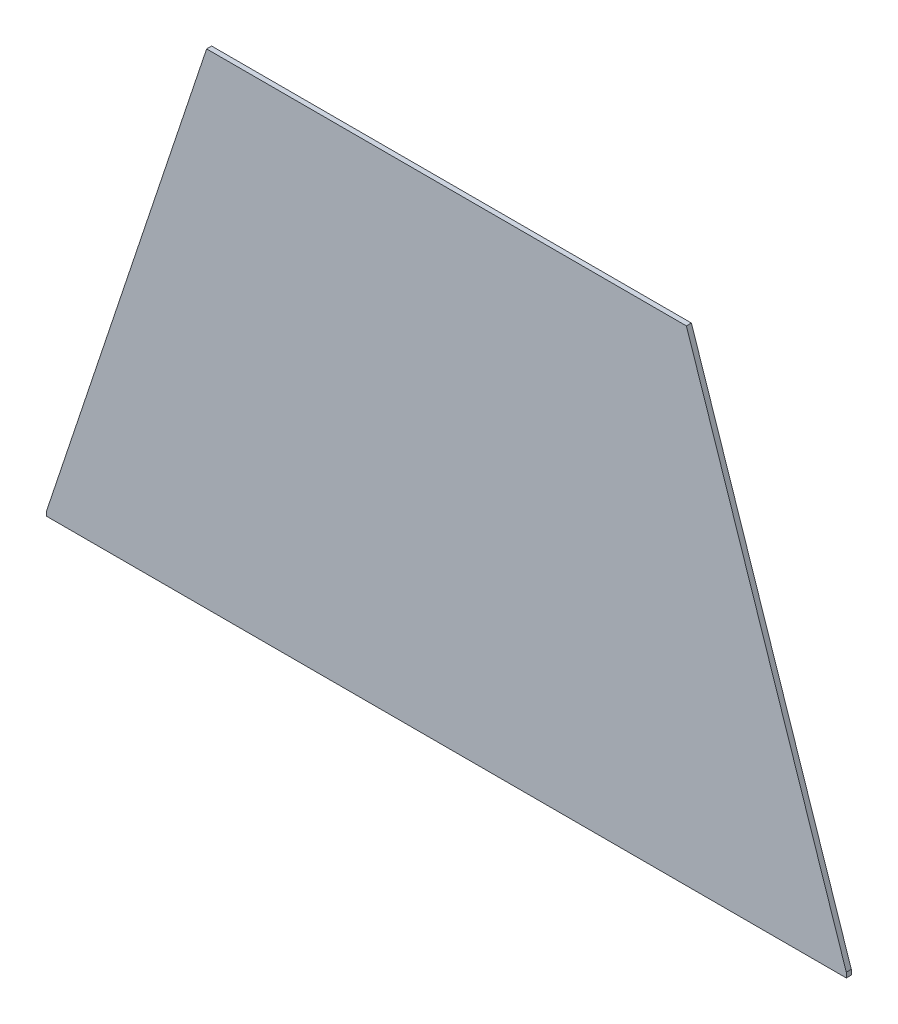
ISO-10303-21;
HEADER;
FILE_DESCRIPTION(('STEP AP214'),'2;1');
FILE_NAME('part.step','',(''),(''),'','','');
FILE_SCHEMA(('AUTOMOTIVE_DESIGN { 1 0 10303 214 1 1 1 1 }'));
ENDSEC;
DATA;
#1=APPLICATION_CONTEXT('core data for automotive mechanical design processes');
#2=APPLICATION_PROTOCOL_DEFINITION('international standard','automotive_design',2000,#1);
#3=PRODUCT_CONTEXT('',#1,'mechanical');
#4=PRODUCT('Part','Part','',(#3));
#5=PRODUCT_RELATED_PRODUCT_CATEGORY('part','',(#4));
#6=PRODUCT_DEFINITION_FORMATION('','',#4);
#7=PRODUCT_DEFINITION_CONTEXT('part definition',#1,'design');
#8=PRODUCT_DEFINITION('design','',#6,#7);
#9=PRODUCT_DEFINITION_SHAPE('','',#8);
#10=(LENGTH_UNIT() NAMED_UNIT(*) SI_UNIT(.MILLI.,.METRE.));
#11=(NAMED_UNIT(*) PLANE_ANGLE_UNIT() SI_UNIT($,.RADIAN.));
#12=(NAMED_UNIT(*) SI_UNIT($,.STERADIAN.) SOLID_ANGLE_UNIT());
#13=UNCERTAINTY_MEASURE_WITH_UNIT(LENGTH_MEASURE(1.E-05),#10,'distance_accuracy_value','');
#14=(GEOMETRIC_REPRESENTATION_CONTEXT(3) GLOBAL_UNCERTAINTY_ASSIGNED_CONTEXT((#13)) GLOBAL_UNIT_ASSIGNED_CONTEXT((#10,
#11,#12)) REPRESENTATION_CONTEXT('',''));
#15=CARTESIAN_POINT('',(0.,0.,0.));
#16=DIRECTION('',(0.,0.,1.));
#17=DIRECTION('',(1.,0.,0.));
#18=AXIS2_PLACEMENT_3D('',#15,#16,#17);
#19=CARTESIAN_POINT('',(127.,-1.5875,1.5875));
#20=DIRECTION('',(-1.,0.,0.));
#21=DIRECTION('',(0.,0.,1.));
#22=AXIS2_PLACEMENT_3D('',#19,#20,#21);
#23=PLANE('',#22);
#24=DIRECTION('',(0.,1.,0.));
#25=VECTOR('',#24,1.);
#26=CARTESIAN_POINT('',(127.,-1.5875,0.));
#27=LINE('',#26,#25);
#28=CARTESIAN_POINT('',(127.,-1.5875,0.));
#29=VERTEX_POINT('',#28);
#30=CARTESIAN_POINT('',(127.,0.,0.));
#31=VERTEX_POINT('',#30);
#32=EDGE_CURVE('E119',#29,#31,#27,.T.);
#33=ORIENTED_EDGE('',*,*,#32,.T.);
#34=DIRECTION('',(0.,0.,-1.));
#35=VECTOR('',#34,1.);
#36=CARTESIAN_POINT('',(127.,0.,1.5875));
#37=LINE('',#36,#35);
#38=CARTESIAN_POINT('',(127.,0.,1.5875));
#39=VERTEX_POINT('',#38);
#40=EDGE_CURVE('E11',#39,#31,#37,.T.);
#41=ORIENTED_EDGE('',*,*,#40,.F.);
#42=DIRECTION('',(0.,1.,0.));
#43=VECTOR('',#42,1.);
#44=CARTESIAN_POINT('',(127.,-1.5875,1.5875));
#45=LINE('',#44,#43);
#46=CARTESIAN_POINT('',(127.,-1.5875,1.5875));
#47=VERTEX_POINT('',#46);
#48=EDGE_CURVE('E129',#47,#39,#45,.T.);
#49=ORIENTED_EDGE('',*,*,#48,.F.);
#50=DIRECTION('',(0.,0.,-1.));
#51=VECTOR('',#50,1.);
#52=CARTESIAN_POINT('',(127.,-1.5875,1.5875));
#53=LINE('',#52,#51);
#54=EDGE_CURVE('E115',#47,#29,#53,.T.);
#55=ORIENTED_EDGE('',*,*,#54,.T.);
#56=EDGE_LOOP('',(#33,#41,#49,#55));
#57=FACE_BOUND('',#56,.T.);
#58=ADVANCED_FACE('F35',(#57),#23,.F.);
#59=CARTESIAN_POINT('',(76.2,152.4,1.5875));
#60=DIRECTION('',(-0.948683298050514,-0.316227766016838,0.));
#61=DIRECTION('',(0.316227766016838,-0.948683298050514,0.));
#62=AXIS2_PLACEMENT_3D('',#59,#60,#61);
#63=PLANE('',#62);
#64=DIRECTION('',(-0.316227766016838,0.948683298050514,0.));
#65=VECTOR('',#64,1.);
#66=CARTESIAN_POINT('',(76.2,152.4,0.));
#67=LINE('',#66,#65);
#68=CARTESIAN_POINT('',(76.2,152.4,0.));
#69=VERTEX_POINT('',#68);
#70=EDGE_CURVE('E122',#31,#69,#67,.T.);
#71=ORIENTED_EDGE('',*,*,#70,.T.);
#72=DIRECTION('',(0.,0.,-1.));
#73=VECTOR('',#72,1.);
#74=CARTESIAN_POINT('',(76.2,152.4,1.5875));
#75=LINE('',#74,#73);
#76=CARTESIAN_POINT('',(76.2,152.4,1.5875));
#77=VERTEX_POINT('',#76);
#78=EDGE_CURVE('E43',#77,#69,#75,.T.);
#79=ORIENTED_EDGE('',*,*,#78,.F.);
#80=DIRECTION('',(-0.316227766016838,0.948683298050514,0.));
#81=VECTOR('',#80,1.);
#82=CARTESIAN_POINT('',(76.2,152.4,1.5875));
#83=LINE('',#82,#81);
#84=EDGE_CURVE('E88',#39,#77,#83,.T.);
#85=ORIENTED_EDGE('',*,*,#84,.F.);
#86=ORIENTED_EDGE('',*,*,#40,.T.);
#87=EDGE_LOOP('',(#71,#79,#85,#86));
#88=FACE_BOUND('',#87,.T.);
#89=ADVANCED_FACE('F153',(#88),#63,.F.);
#90=CARTESIAN_POINT('',(-76.2,152.4,1.5875));
#91=DIRECTION('',(0.,-1.,0.));
#92=DIRECTION('',(0.,0.,-1.));
#93=AXIS2_PLACEMENT_3D('',#90,#91,#92);
#94=PLANE('',#93);
#95=DIRECTION('',(-1.,0.,0.));
#96=VECTOR('',#95,1.);
#97=CARTESIAN_POINT('',(-76.2,152.4,0.));
#98=LINE('',#97,#96);
#99=CARTESIAN_POINT('',(-76.2,152.4,0.));
#100=VERTEX_POINT('',#99);
#101=EDGE_CURVE('E124',#69,#100,#98,.T.);
#102=ORIENTED_EDGE('',*,*,#101,.T.);
#103=DIRECTION('',(0.,0.,-1.));
#104=VECTOR('',#103,1.);
#105=CARTESIAN_POINT('',(-76.2,152.4,1.5875));
#106=LINE('',#105,#104);
#107=CARTESIAN_POINT('',(-76.2,152.4,1.5875));
#108=VERTEX_POINT('',#107);
#109=EDGE_CURVE('E110',#108,#100,#106,.T.);
#110=ORIENTED_EDGE('',*,*,#109,.F.);
#111=DIRECTION('',(-1.,0.,0.));
#112=VECTOR('',#111,1.);
#113=CARTESIAN_POINT('',(-76.2,152.4,1.5875));
#114=LINE('',#113,#112);
#115=EDGE_CURVE('E101',#77,#108,#114,.T.);
#116=ORIENTED_EDGE('',*,*,#115,.F.);
#117=ORIENTED_EDGE('',*,*,#78,.T.);
#118=EDGE_LOOP('',(#102,#110,#116,#117));
#119=FACE_BOUND('',#118,.T.);
#120=ADVANCED_FACE('F135',(#119),#94,.F.);
#121=CARTESIAN_POINT('',(-127.,0.,1.5875));
#122=DIRECTION('',(0.948683298050514,-0.316227766016838,0.));
#123=DIRECTION('',(0.316227766016838,0.948683298050514,0.));
#124=AXIS2_PLACEMENT_3D('',#121,#122,#123);
#125=PLANE('',#124);
#126=DIRECTION('',(-0.316227766016838,-0.948683298050514,0.));
#127=VECTOR('',#126,1.);
#128=CARTESIAN_POINT('',(-127.,0.,0.));
#129=LINE('',#128,#127);
#130=CARTESIAN_POINT('',(-127.,0.,0.));
#131=VERTEX_POINT('',#130);
#132=EDGE_CURVE('E109',#100,#131,#129,.T.);
#133=ORIENTED_EDGE('',*,*,#132,.T.);
#134=DIRECTION('',(0.,0.,-1.));
#135=VECTOR('',#134,1.);
#136=CARTESIAN_POINT('',(-127.,0.,1.5875));
#137=LINE('',#136,#135);
#138=CARTESIAN_POINT('',(-127.,0.,1.5875));
#139=VERTEX_POINT('',#138);
#140=EDGE_CURVE('E106',#139,#131,#137,.T.);
#141=ORIENTED_EDGE('',*,*,#140,.F.);
#142=DIRECTION('',(-0.316227766016838,-0.948683298050514,0.));
#143=VECTOR('',#142,1.);
#144=CARTESIAN_POINT('',(-127.,0.,1.5875));
#145=LINE('',#144,#143);
#146=EDGE_CURVE('E95',#108,#139,#145,.T.);
#147=ORIENTED_EDGE('',*,*,#146,.F.);
#148=ORIENTED_EDGE('',*,*,#109,.T.);
#149=EDGE_LOOP('',(#133,#141,#147,#148));
#150=FACE_BOUND('',#149,.T.);
#151=ADVANCED_FACE('F107',(#150),#125,.F.);
#152=CARTESIAN_POINT('',(-127.,0.,1.5875));
#153=DIRECTION('',(1.,0.,0.));
#154=DIRECTION('',(0.,0.,-1.));
#155=AXIS2_PLACEMENT_3D('',#152,#153,#154);
#156=PLANE('',#155);
#157=DIRECTION('',(0.,-1.,0.));
#158=VECTOR('',#157,1.);
#159=CARTESIAN_POINT('',(-127.,0.,0.));
#160=LINE('',#159,#158);
#161=CARTESIAN_POINT('',(-127.,-1.5875,0.));
#162=VERTEX_POINT('',#161);
#163=EDGE_CURVE('E74',#131,#162,#160,.T.);
#164=ORIENTED_EDGE('',*,*,#163,.T.);
#165=DIRECTION('',(0.,0.,-1.));
#166=VECTOR('',#165,1.);
#167=CARTESIAN_POINT('',(-127.,-1.5875,1.5875));
#168=LINE('',#167,#166);
#169=CARTESIAN_POINT('',(-127.,-1.5875,1.5875));
#170=VERTEX_POINT('',#169);
#171=EDGE_CURVE('E111',#170,#162,#168,.T.);
#172=ORIENTED_EDGE('',*,*,#171,.F.);
#173=DIRECTION('',(0.,-1.,0.));
#174=VECTOR('',#173,1.);
#175=CARTESIAN_POINT('',(-127.,0.,1.5875));
#176=LINE('',#175,#174);
#177=EDGE_CURVE('E99',#139,#170,#176,.T.);
#178=ORIENTED_EDGE('',*,*,#177,.F.);
#179=ORIENTED_EDGE('',*,*,#140,.T.);
#180=EDGE_LOOP('',(#164,#172,#178,#179));
#181=FACE_BOUND('',#180,.T.);
#182=ADVANCED_FACE('F113',(#181),#156,.F.);
#183=CARTESIAN_POINT('',(-127.,-1.5875,1.5875));
#184=DIRECTION('',(0.,1.,0.));
#185=DIRECTION('',(0.,0.,1.));
#186=AXIS2_PLACEMENT_3D('',#183,#184,#185);
#187=PLANE('',#186);
#188=DIRECTION('',(1.,0.,0.));
#189=VECTOR('',#188,1.);
#190=CARTESIAN_POINT('',(-127.,-1.5875,0.));
#191=LINE('',#190,#189);
#192=EDGE_CURVE('E80',#162,#29,#191,.T.);
#193=ORIENTED_EDGE('',*,*,#192,.T.);
#194=ORIENTED_EDGE('',*,*,#54,.F.);
#195=DIRECTION('',(1.,0.,0.));
#196=VECTOR('',#195,1.);
#197=CARTESIAN_POINT('',(-127.,-1.5875,1.5875));
#198=LINE('',#197,#196);
#199=EDGE_CURVE('E51',#170,#47,#198,.T.);
#200=ORIENTED_EDGE('',*,*,#199,.F.);
#201=ORIENTED_EDGE('',*,*,#171,.T.);
#202=EDGE_LOOP('',(#193,#194,#200,#201));
#203=FACE_BOUND('',#202,.T.);
#204=ADVANCED_FACE('F142',(#203),#187,.F.);
#205=CARTESIAN_POINT('',(0.,0.,1.5875));
#206=DIRECTION('',(0.,0.,-1.));
#207=DIRECTION('',(-1.,0.,0.));
#208=AXIS2_PLACEMENT_3D('',#205,#206,#207);
#209=PLANE('',#208);
#210=ORIENTED_EDGE('',*,*,#48,.T.);
#211=ORIENTED_EDGE('',*,*,#84,.T.);
#212=ORIENTED_EDGE('',*,*,#115,.T.);
#213=ORIENTED_EDGE('',*,*,#146,.T.);
#214=ORIENTED_EDGE('',*,*,#177,.T.);
#215=ORIENTED_EDGE('',*,*,#199,.T.);
#216=EDGE_LOOP('',(#210,#211,#212,#213,#214,#215));
#217=FACE_BOUND('',#216,.T.);
#218=ADVANCED_FACE('F97',(#217),#209,.F.);
#219=CARTESIAN_POINT('',(0.,0.,0.));
#220=DIRECTION('',(0.,0.,-1.));
#221=DIRECTION('',(-1.,0.,0.));
#222=AXIS2_PLACEMENT_3D('',#219,#220,#221);
#223=PLANE('',#222);
#224=ORIENTED_EDGE('',*,*,#32,.F.);
#225=ORIENTED_EDGE('',*,*,#192,.F.);
#226=ORIENTED_EDGE('',*,*,#163,.F.);
#227=ORIENTED_EDGE('',*,*,#132,.F.);
#228=ORIENTED_EDGE('',*,*,#101,.F.);
#229=ORIENTED_EDGE('',*,*,#70,.F.);
#230=EDGE_LOOP('',(#224,#225,#226,#227,#228,#229));
#231=FACE_BOUND('',#230,.T.);
#232=ADVANCED_FACE('F138',(#231),#223,.T.);
#233=CLOSED_SHELL('',(#58,#89,#120,#151,#182,#204,#218,#232));
#234=MANIFOLD_SOLID_BREP('B2',#233);
#235=ADVANCED_BREP_SHAPE_REPRESENTATION('',(#18,#234),#14);
#236=SHAPE_DEFINITION_REPRESENTATION(#9,#235);
ENDSEC;
END-ISO-10303-21;
